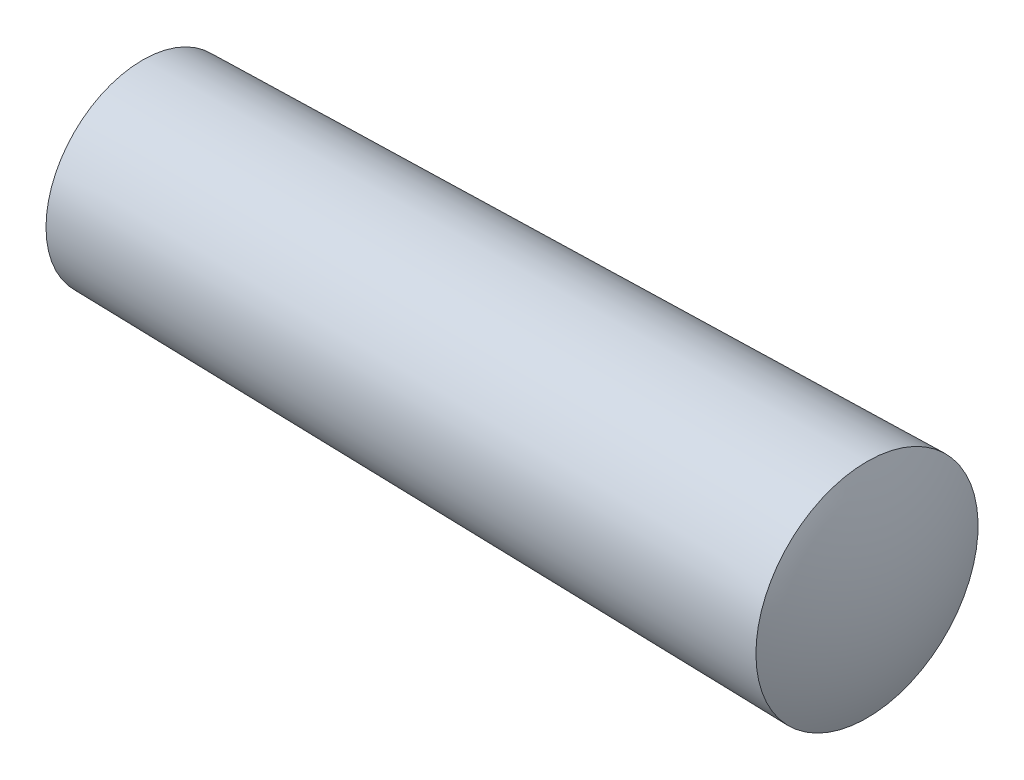
ISO-10303-21;
HEADER;
FILE_DESCRIPTION(('STEP AP214'),'2;1');
FILE_NAME('part.step','',(''),(''),'','','');
FILE_SCHEMA(('AUTOMOTIVE_DESIGN { 1 0 10303 214 1 1 1 1 }'));
ENDSEC;
DATA;
#1=APPLICATION_CONTEXT('core data for automotive mechanical design processes');
#2=APPLICATION_PROTOCOL_DEFINITION('international standard','automotive_design',2000,#1);
#3=PRODUCT_CONTEXT('',#1,'mechanical');
#4=PRODUCT('Part','Part','',(#3));
#5=PRODUCT_RELATED_PRODUCT_CATEGORY('part','',(#4));
#6=PRODUCT_DEFINITION_FORMATION('','',#4);
#7=PRODUCT_DEFINITION_CONTEXT('part definition',#1,'design');
#8=PRODUCT_DEFINITION('design','',#6,#7);
#9=PRODUCT_DEFINITION_SHAPE('','',#8);
#10=(LENGTH_UNIT() NAMED_UNIT(*) SI_UNIT(.MILLI.,.METRE.));
#11=(NAMED_UNIT(*) PLANE_ANGLE_UNIT() SI_UNIT($,.RADIAN.));
#12=(NAMED_UNIT(*) SI_UNIT($,.STERADIAN.) SOLID_ANGLE_UNIT());
#13=UNCERTAINTY_MEASURE_WITH_UNIT(LENGTH_MEASURE(1.E-05),#10,'distance_accuracy_value','');
#14=(GEOMETRIC_REPRESENTATION_CONTEXT(3) GLOBAL_UNCERTAINTY_ASSIGNED_CONTEXT((#13)) GLOBAL_UNIT_ASSIGNED_CONTEXT((#10,
#11,#12)) REPRESENTATION_CONTEXT('',''));
#15=CARTESIAN_POINT('',(0.,0.,0.));
#16=DIRECTION('',(0.,0.,1.));
#17=DIRECTION('',(1.,0.,0.));
#18=AXIS2_PLACEMENT_3D('',#15,#16,#17);
#19=CARTESIAN_POINT('',(8.49999999999999,0.,0.));
#20=DIRECTION('',(-1.,0.,0.));
#21=DIRECTION('',(0.,1.,0.));
#22=AXIS2_PLACEMENT_3D('',#19,#20,#21);
#23=SPHERICAL_SURFACE('',#22,8.49999999999999);
#24=CARTESIAN_POINT('',(1.,0.,0.));
#25=DIRECTION('',(-1.,0.,0.));
#26=DIRECTION('',(0.,0.,1.));
#27=AXIS2_PLACEMENT_3D('',#24,#25,#26);
#28=CIRCLE('',#27,4.);
#29=CARTESIAN_POINT('',(1.,0.,4.));
#30=VERTEX_POINT('',#29);
#31=EDGE_CURVE('E41',#30,#30,#28,.T.);
#32=ORIENTED_EDGE('',*,*,#31,.T.);
#33=EDGE_LOOP('',(#32));
#34=FACE_BOUND('',#33,.T.);
#35=ADVANCED_FACE('F35',(#34),#23,.T.);
#36=CARTESIAN_POINT('',(20.92,0.,0.));
#37=DIRECTION('',(-1.,0.,0.));
#38=DIRECTION('',(0.,1.,0.));
#39=AXIS2_PLACEMENT_3D('',#36,#37,#38);
#40=SPHERICAL_SURFACE('',#39,11.08);
#41=CARTESIAN_POINT('',(31.,0.,0.));
#42=DIRECTION('',(-1.,0.,0.));
#43=DIRECTION('',(0.,0.,1.));
#44=AXIS2_PLACEMENT_3D('',#41,#42,#43);
#45=CIRCLE('',#44,4.6);
#46=CARTESIAN_POINT('',(31.,0.,4.6));
#47=VERTEX_POINT('',#46);
#48=EDGE_CURVE('E10',#47,#47,#45,.T.);
#49=ORIENTED_EDGE('',*,*,#48,.F.);
#50=EDGE_LOOP('',(#49));
#51=FACE_BOUND('',#50,.T.);
#52=ADVANCED_FACE('F50',(#51),#40,.T.);
#53=CARTESIAN_POINT('',(31.,0.,0.));
#54=DIRECTION('',(1.,0.,0.));
#55=DIRECTION('',(0.,0.,-1.));
#56=AXIS2_PLACEMENT_3D('',#53,#54,#55);
#57=CONICAL_SURFACE('',#56,4.6,0.0199973339731505);
#58=ORIENTED_EDGE('',*,*,#31,.F.);
#59=EDGE_LOOP('',(#58));
#60=FACE_BOUND('',#59,.T.);
#61=ORIENTED_EDGE('',*,*,#48,.T.);
#62=EDGE_LOOP('',(#61));
#63=FACE_BOUND('',#62,.T.);
#64=ADVANCED_FACE('F48',(#60,#63),#57,.T.);
#65=CLOSED_SHELL('',(#35,#52,#64));
#66=MANIFOLD_SOLID_BREP('B2',#65);
#67=ADVANCED_BREP_SHAPE_REPRESENTATION('',(#18,#66),#14);
#68=SHAPE_DEFINITION_REPRESENTATION(#9,#67);
ENDSEC;
END-ISO-10303-21;
